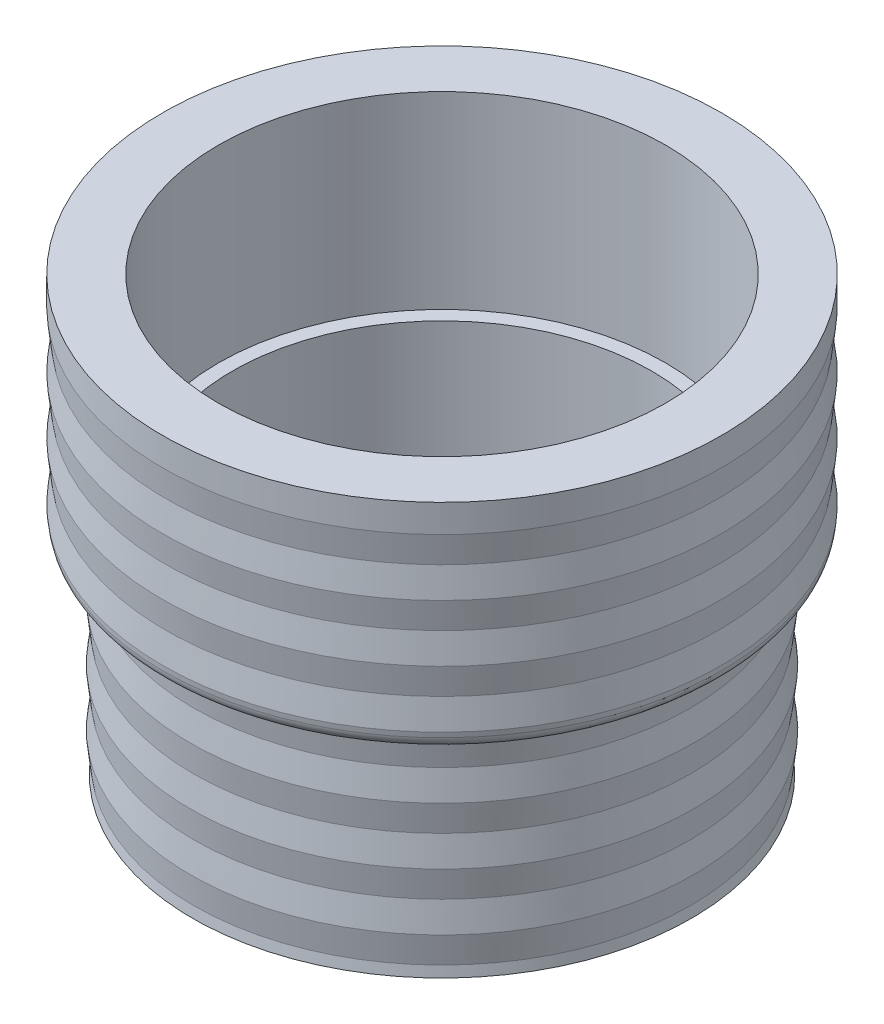
ISO-10303-21;
HEADER;
FILE_DESCRIPTION(('STEP AP214'),'2;1');
FILE_NAME('part.step','',(''),(''),'','','');
FILE_SCHEMA(('AUTOMOTIVE_DESIGN { 1 0 10303 214 1 1 1 1 }'));
ENDSEC;
DATA;
#1=APPLICATION_CONTEXT('core data for automotive mechanical design processes');
#2=APPLICATION_PROTOCOL_DEFINITION('international standard','automotive_design',2000,#1);
#3=PRODUCT_CONTEXT('',#1,'mechanical');
#4=PRODUCT('Part','Part','',(#3));
#5=PRODUCT_RELATED_PRODUCT_CATEGORY('part','',(#4));
#6=PRODUCT_DEFINITION_FORMATION('','',#4);
#7=PRODUCT_DEFINITION_CONTEXT('part definition',#1,'design');
#8=PRODUCT_DEFINITION('design','',#6,#7);
#9=PRODUCT_DEFINITION_SHAPE('','',#8);
#10=(LENGTH_UNIT() NAMED_UNIT(*) SI_UNIT(.MILLI.,.METRE.));
#11=(NAMED_UNIT(*) PLANE_ANGLE_UNIT() SI_UNIT($,.RADIAN.));
#12=(NAMED_UNIT(*) SI_UNIT($,.STERADIAN.) SOLID_ANGLE_UNIT());
#13=UNCERTAINTY_MEASURE_WITH_UNIT(LENGTH_MEASURE(1.E-05),#10,'distance_accuracy_value','');
#14=(GEOMETRIC_REPRESENTATION_CONTEXT(3) GLOBAL_UNCERTAINTY_ASSIGNED_CONTEXT((#13)) GLOBAL_UNIT_ASSIGNED_CONTEXT((#10,
#11,#12)) REPRESENTATION_CONTEXT('',''));
#15=CARTESIAN_POINT('',(0.,0.,0.));
#16=DIRECTION('',(0.,0.,1.));
#17=DIRECTION('',(1.,0.,0.));
#18=AXIS2_PLACEMENT_3D('',#15,#16,#17);
#19=CARTESIAN_POINT('',(0.,-40.6565698055981,0.));
#20=DIRECTION('',(0.,-1.,0.));
#21=DIRECTION('',(0.,0.,-1.));
#22=AXIS2_PLACEMENT_3D('',#19,#20,#21);
#23=CYLINDRICAL_SURFACE('',#22,31.75);
#24=CARTESIAN_POINT('',(0.,46.0375,0.));
#25=DIRECTION('',(0.,-1.,0.));
#26=DIRECTION('',(0.,0.,-1.));
#27=AXIS2_PLACEMENT_3D('',#24,#25,#26);
#28=CIRCLE('',#27,31.75);
#29=CARTESIAN_POINT('',(0.,46.0375,-31.75));
#30=VERTEX_POINT('',#29);
#31=EDGE_CURVE('E76',#30,#30,#28,.T.);
#32=ORIENTED_EDGE('',*,*,#31,.F.);
#33=EDGE_LOOP('',(#32));
#34=FACE_BOUND('',#33,.T.);
#35=CARTESIAN_POINT('',(0.,49.2125,0.));
#36=DIRECTION('',(0.,-1.,0.));
#37=DIRECTION('',(0.,0.,-1.));
#38=AXIS2_PLACEMENT_3D('',#35,#36,#37);
#39=CIRCLE('',#38,31.75);
#40=CARTESIAN_POINT('',(0.,49.2125,-31.75));
#41=VERTEX_POINT('',#40);
#42=EDGE_CURVE('E64',#41,#41,#39,.T.);
#43=ORIENTED_EDGE('',*,*,#42,.T.);
#44=EDGE_LOOP('',(#43));
#45=FACE_BOUND('',#44,.T.);
#46=ADVANCED_FACE('F33',(#34,#45),#23,.T.);
#47=CARTESIAN_POINT('',(0.,-40.6565698055981,0.));
#48=DIRECTION('',(0.,-1.,0.));
#49=DIRECTION('',(0.,0.,-1.));
#50=AXIS2_PLACEMENT_3D('',#47,#48,#49);
#51=CYLINDRICAL_SURFACE('',#50,23.8125);
#52=CARTESIAN_POINT('',(0.,27.78125,0.));
#53=DIRECTION('',(0.,-1.,0.));
#54=DIRECTION('',(0.,0.,-1.));
#55=AXIS2_PLACEMENT_3D('',#52,#53,#54);
#56=CIRCLE('',#55,23.8125);
#57=CARTESIAN_POINT('',(0.,27.78125,-23.8125));
#58=VERTEX_POINT('',#57);
#59=EDGE_CURVE('E73',#58,#58,#56,.T.);
#60=ORIENTED_EDGE('',*,*,#59,.F.);
#61=EDGE_LOOP('',(#60));
#62=FACE_BOUND('',#61,.T.);
#63=CARTESIAN_POINT('',(0.,6.35,0.));
#64=DIRECTION('',(0.,-1.,0.));
#65=DIRECTION('',(0.,0.,-1.));
#66=AXIS2_PLACEMENT_3D('',#63,#64,#65);
#67=CIRCLE('',#66,23.8125);
#68=CARTESIAN_POINT('',(0.,6.35,-23.8125));
#69=VERTEX_POINT('',#68);
#70=EDGE_CURVE('E44',#69,#69,#67,.T.);
#71=ORIENTED_EDGE('',*,*,#70,.T.);
#72=EDGE_LOOP('',(#71));
#73=FACE_BOUND('',#72,.T.);
#74=ADVANCED_FACE('F161',(#62,#73),#51,.F.);
#75=CARTESIAN_POINT('',(0.,6.35,0.));
#76=DIRECTION('',(0.,-1.,0.));
#77=DIRECTION('',(0.,0.,-1.));
#78=AXIS2_PLACEMENT_3D('',#75,#76,#77);
#79=PLANE('',#78);
#80=ORIENTED_EDGE('',*,*,#70,.F.);
#81=EDGE_LOOP('',(#80));
#82=FACE_BOUND('',#81,.T.);
#83=CARTESIAN_POINT('',(0.,6.35,0.));
#84=DIRECTION('',(0.,-1.,0.));
#85=DIRECTION('',(0.,0.,-1.));
#86=AXIS2_PLACEMENT_3D('',#83,#84,#85);
#87=CIRCLE('',#86,22.225);
#88=CARTESIAN_POINT('',(0.,6.35,-22.225));
#89=VERTEX_POINT('',#88);
#90=EDGE_CURVE('E48',#89,#89,#87,.T.);
#91=ORIENTED_EDGE('',*,*,#90,.T.);
#92=EDGE_LOOP('',(#91));
#93=FACE_BOUND('',#92,.T.);
#94=ADVANCED_FACE('F185',(#82,#93),#79,.F.);
#95=CARTESIAN_POINT('',(0.,-40.6565698055981,0.));
#96=DIRECTION('',(0.,-1.,0.));
#97=DIRECTION('',(0.,0.,-1.));
#98=AXIS2_PLACEMENT_3D('',#95,#96,#97);
#99=CYLINDRICAL_SURFACE('',#98,22.225);
#100=ORIENTED_EDGE('',*,*,#90,.F.);
#101=EDGE_LOOP('',(#100));
#102=FACE_BOUND('',#101,.T.);
#103=CARTESIAN_POINT('',(0.,0.,0.));
#104=DIRECTION('',(0.,-1.,0.));
#105=DIRECTION('',(0.,0.,-1.));
#106=AXIS2_PLACEMENT_3D('',#103,#104,#105);
#107=CIRCLE('',#106,22.225);
#108=CARTESIAN_POINT('',(0.,0.,-22.225));
#109=VERTEX_POINT('',#108);
#110=EDGE_CURVE('E58',#109,#109,#107,.T.);
#111=ORIENTED_EDGE('',*,*,#110,.T.);
#112=EDGE_LOOP('',(#111));
#113=FACE_BOUND('',#112,.T.);
#114=ADVANCED_FACE('F190',(#102,#113),#99,.F.);
#115=CARTESIAN_POINT('',(0.,0.,0.));
#116=DIRECTION('',(0.,-1.,0.));
#117=DIRECTION('',(0.,0.,-1.));
#118=AXIS2_PLACEMENT_3D('',#115,#116,#117);
#119=PLANE('',#118);
#120=CARTESIAN_POINT('',(0.,0.,0.));
#121=DIRECTION('',(0.,-1.,0.));
#122=DIRECTION('',(0.,0.,-1.));
#123=AXIS2_PLACEMENT_3D('',#120,#121,#122);
#124=CIRCLE('',#123,28.332205882353);
#125=CARTESIAN_POINT('',(0.,0.,-28.332205882353));
#126=VERTEX_POINT('',#125);
#127=EDGE_CURVE('E51',#126,#126,#124,.F.);
#128=ORIENTED_EDGE('',*,*,#127,.F.);
#129=EDGE_LOOP('',(#128));
#130=FACE_BOUND('',#129,.T.);
#131=ORIENTED_EDGE('',*,*,#110,.F.);
#132=EDGE_LOOP('',(#131));
#133=FACE_BOUND('',#132,.T.);
#134=ADVANCED_FACE('F169',(#130,#133),#119,.T.);
#135=CARTESIAN_POINT('',(0.,49.2125,0.));
#136=DIRECTION('',(0.,-1.,0.));
#137=DIRECTION('',(0.,0.,-1.));
#138=AXIS2_PLACEMENT_3D('',#135,#136,#137);
#139=PLANE('',#138);
#140=ORIENTED_EDGE('',*,*,#42,.F.);
#141=EDGE_LOOP('',(#140));
#142=FACE_BOUND('',#141,.T.);
#143=CARTESIAN_POINT('',(0.,49.2125,0.));
#144=DIRECTION('',(0.,-1.,0.));
#145=DIRECTION('',(0.,0.,-1.));
#146=AXIS2_PLACEMENT_3D('',#143,#144,#145);
#147=CIRCLE('',#146,25.4);
#148=CARTESIAN_POINT('',(0.,49.2125,-25.4));
#149=VERTEX_POINT('',#148);
#150=EDGE_CURVE('E67',#149,#149,#147,.T.);
#151=ORIENTED_EDGE('',*,*,#150,.T.);
#152=EDGE_LOOP('',(#151));
#153=FACE_BOUND('',#152,.T.);
#154=ADVANCED_FACE('F165',(#142,#153),#139,.F.);
#155=CARTESIAN_POINT('',(0.,-40.6565698055981,0.));
#156=DIRECTION('',(0.,-1.,0.));
#157=DIRECTION('',(0.,0.,-1.));
#158=AXIS2_PLACEMENT_3D('',#155,#156,#157);
#159=CYLINDRICAL_SURFACE('',#158,25.4);
#160=ORIENTED_EDGE('',*,*,#150,.F.);
#161=EDGE_LOOP('',(#160));
#162=FACE_BOUND('',#161,.T.);
#163=CARTESIAN_POINT('',(0.,27.78125,0.));
#164=DIRECTION('',(0.,-1.,0.));
#165=DIRECTION('',(0.,0.,-1.));
#166=AXIS2_PLACEMENT_3D('',#163,#164,#165);
#167=CIRCLE('',#166,25.4);
#168=CARTESIAN_POINT('',(0.,27.78125,-25.4));
#169=VERTEX_POINT('',#168);
#170=EDGE_CURVE('E70',#169,#169,#167,.T.);
#171=ORIENTED_EDGE('',*,*,#170,.T.);
#172=EDGE_LOOP('',(#171));
#173=FACE_BOUND('',#172,.T.);
#174=ADVANCED_FACE('F168',(#162,#173),#159,.F.);
#175=CARTESIAN_POINT('',(0.,27.78125,0.));
#176=DIRECTION('',(0.,-1.,0.));
#177=DIRECTION('',(0.,0.,-1.));
#178=AXIS2_PLACEMENT_3D('',#175,#176,#177);
#179=PLANE('',#178);
#180=ORIENTED_EDGE('',*,*,#170,.F.);
#181=EDGE_LOOP('',(#180));
#182=FACE_BOUND('',#181,.T.);
#183=ORIENTED_EDGE('',*,*,#59,.T.);
#184=EDGE_LOOP('',(#183));
#185=FACE_BOUND('',#184,.T.);
#186=ADVANCED_FACE('F155',(#182,#185),#179,.F.);
#187=CARTESIAN_POINT('',(0.,46.0375,0.));
#188=DIRECTION('',(0.,1.,0.));
#189=DIRECTION('',(0.,0.,1.));
#190=AXIS2_PLACEMENT_3D('',#187,#188,#189);
#191=CONICAL_SURFACE('',#190,31.75,0.117108744566864);
#192=CARTESIAN_POINT('',(0.,42.799,0.));
#193=DIRECTION('',(0.,-1.,0.));
#194=DIRECTION('',(0.,0.,-1.));
#195=AXIS2_PLACEMENT_3D('',#192,#193,#194);
#196=CIRCLE('',#195,31.369);
#197=CARTESIAN_POINT('',(0.,42.799,-31.369));
#198=VERTEX_POINT('',#197);
#199=EDGE_CURVE('E80',#198,#198,#196,.T.);
#200=ORIENTED_EDGE('',*,*,#199,.F.);
#201=EDGE_LOOP('',(#200));
#202=FACE_BOUND('',#201,.T.);
#203=ORIENTED_EDGE('',*,*,#31,.T.);
#204=EDGE_LOOP('',(#203));
#205=FACE_BOUND('',#204,.T.);
#206=ADVANCED_FACE('F149',(#202,#205),#191,.T.);
#207=CARTESIAN_POINT('',(0.,42.799,0.));
#208=DIRECTION('',(0.,-1.,0.));
#209=DIRECTION('',(0.,0.,-1.));
#210=AXIS2_PLACEMENT_3D('',#207,#208,#209);
#211=CONICAL_SURFACE('',#210,31.369,0.117108744566864);
#212=CARTESIAN_POINT('',(0.,39.5605,0.));
#213=DIRECTION('',(0.,-1.,0.));
#214=DIRECTION('',(0.,0.,-1.));
#215=AXIS2_PLACEMENT_3D('',#212,#213,#214);
#216=CIRCLE('',#215,31.75);
#217=CARTESIAN_POINT('',(0.,39.5605,-31.75));
#218=VERTEX_POINT('',#217);
#219=EDGE_CURVE('E84',#218,#218,#216,.T.);
#220=ORIENTED_EDGE('',*,*,#219,.F.);
#221=EDGE_LOOP('',(#220));
#222=FACE_BOUND('',#221,.T.);
#223=ORIENTED_EDGE('',*,*,#199,.T.);
#224=EDGE_LOOP('',(#223));
#225=FACE_BOUND('',#224,.T.);
#226=ADVANCED_FACE('F143',(#222,#225),#211,.T.);
#227=CARTESIAN_POINT('',(0.,39.5605,0.));
#228=DIRECTION('',(0.,1.,0.));
#229=DIRECTION('',(0.,0.,1.));
#230=AXIS2_PLACEMENT_3D('',#227,#228,#229);
#231=CONICAL_SURFACE('',#230,31.75,0.117108744566864);
#232=CARTESIAN_POINT('',(0.,36.322,0.));
#233=DIRECTION('',(0.,-1.,0.));
#234=DIRECTION('',(0.,0.,-1.));
#235=AXIS2_PLACEMENT_3D('',#232,#233,#234);
#236=CIRCLE('',#235,31.369);
#237=CARTESIAN_POINT('',(0.,36.322,-31.369));
#238=VERTEX_POINT('',#237);
#239=EDGE_CURVE('E92',#238,#238,#236,.T.);
#240=ORIENTED_EDGE('',*,*,#239,.F.);
#241=EDGE_LOOP('',(#240));
#242=FACE_BOUND('',#241,.T.);
#243=ORIENTED_EDGE('',*,*,#219,.T.);
#244=EDGE_LOOP('',(#243));
#245=FACE_BOUND('',#244,.T.);
#246=ADVANCED_FACE('F137',(#242,#245),#231,.T.);
#247=CARTESIAN_POINT('',(0.,36.322,0.));
#248=DIRECTION('',(0.,-1.,0.));
#249=DIRECTION('',(0.,0.,-1.));
#250=AXIS2_PLACEMENT_3D('',#247,#248,#249);
#251=CONICAL_SURFACE('',#250,31.369,0.117108744566864);
#252=CARTESIAN_POINT('',(0.,33.0835,0.));
#253=DIRECTION('',(0.,-1.,0.));
#254=DIRECTION('',(0.,0.,-1.));
#255=AXIS2_PLACEMENT_3D('',#252,#253,#254);
#256=CIRCLE('',#255,31.75);
#257=CARTESIAN_POINT('',(0.,33.0835,-31.75));
#258=VERTEX_POINT('',#257);
#259=EDGE_CURVE('E96',#258,#258,#256,.T.);
#260=ORIENTED_EDGE('',*,*,#259,.F.);
#261=EDGE_LOOP('',(#260));
#262=FACE_BOUND('',#261,.T.);
#263=ORIENTED_EDGE('',*,*,#239,.T.);
#264=EDGE_LOOP('',(#263));
#265=FACE_BOUND('',#264,.T.);
#266=ADVANCED_FACE('F131',(#262,#265),#251,.T.);
#267=CARTESIAN_POINT('',(0.,33.0835,0.));
#268=DIRECTION('',(0.,1.,0.));
#269=DIRECTION('',(0.,0.,1.));
#270=AXIS2_PLACEMENT_3D('',#267,#268,#269);
#271=CONICAL_SURFACE('',#270,31.75,0.117108744566864);
#272=CARTESIAN_POINT('',(0.,29.845,0.));
#273=DIRECTION('',(0.,-1.,0.));
#274=DIRECTION('',(0.,0.,-1.));
#275=AXIS2_PLACEMENT_3D('',#272,#273,#274);
#276=CIRCLE('',#275,31.369);
#277=CARTESIAN_POINT('',(0.,29.845,-31.369));
#278=VERTEX_POINT('',#277);
#279=EDGE_CURVE('E104',#278,#278,#276,.T.);
#280=ORIENTED_EDGE('',*,*,#279,.F.);
#281=EDGE_LOOP('',(#280));
#282=FACE_BOUND('',#281,.T.);
#283=ORIENTED_EDGE('',*,*,#259,.T.);
#284=EDGE_LOOP('',(#283));
#285=FACE_BOUND('',#284,.T.);
#286=ADVANCED_FACE('F125',(#282,#285),#271,.T.);
#287=CARTESIAN_POINT('',(0.,29.845,0.));
#288=DIRECTION('',(0.,-1.,0.));
#289=DIRECTION('',(0.,0.,-1.));
#290=AXIS2_PLACEMENT_3D('',#287,#288,#289);
#291=CONICAL_SURFACE('',#290,31.369,0.117108744566864);
#292=CARTESIAN_POINT('',(0.,26.6065,0.));
#293=DIRECTION('',(0.,-1.,0.));
#294=DIRECTION('',(0.,0.,-1.));
#295=AXIS2_PLACEMENT_3D('',#292,#293,#294);
#296=CIRCLE('',#295,31.75);
#297=CARTESIAN_POINT('',(0.,26.6065,-31.75));
#298=VERTEX_POINT('',#297);
#299=EDGE_CURVE('E54',#298,#298,#296,.T.);
#300=ORIENTED_EDGE('',*,*,#299,.F.);
#301=EDGE_LOOP('',(#300));
#302=FACE_BOUND('',#301,.T.);
#303=ORIENTED_EDGE('',*,*,#279,.T.);
#304=EDGE_LOOP('',(#303));
#305=FACE_BOUND('',#304,.T.);
#306=ADVANCED_FACE('F122',(#302,#305),#291,.T.);
#307=CARTESIAN_POINT('',(0.,26.6065,0.));
#308=DIRECTION('',(0.,1.,0.));
#309=DIRECTION('',(0.,0.,1.));
#310=AXIS2_PLACEMENT_3D('',#307,#308,#309);
#311=CONICAL_SURFACE('',#310,31.75,0.117108744566864);
#312=CARTESIAN_POINT('',(0.,26.0082645194868,0.));
#313=DIRECTION('',(0.,1.,0.));
#314=DIRECTION('',(0.,0.,1.));
#315=AXIS2_PLACEMENT_3D('',#312,#313,#314);
#316=CIRCLE('',#315,31.6796193552337);
#317=CARTESIAN_POINT('',(0.,26.0082645194868,31.6796193552337));
#318=VERTEX_POINT('',#317);
#319=EDGE_CURVE('E40',#318,#318,#316,.T.);
#320=ORIENTED_EDGE('',*,*,#319,.T.);
#321=EDGE_LOOP('',(#320));
#322=FACE_BOUND('',#321,.T.);
#323=ORIENTED_EDGE('',*,*,#299,.T.);
#324=EDGE_LOOP('',(#323));
#325=FACE_BOUND('',#324,.T.);
#326=ADVANCED_FACE('F120',(#322,#325),#311,.T.);
#327=CARTESIAN_POINT('',(0.,20.60575,0.));
#328=DIRECTION('',(0.,-1.,0.));
#329=DIRECTION('',(0.,0.,-1.));
#330=AXIS2_PLACEMENT_3D('',#327,#328,#329);
#331=CONICAL_SURFACE('',#330,28.194,0.117108744566856);
#332=CARTESIAN_POINT('',(0.,17.36725,0.));
#333=DIRECTION('',(0.,-1.,0.));
#334=DIRECTION('',(0.,0.,-1.));
#335=AXIS2_PLACEMENT_3D('',#332,#333,#334);
#336=CIRCLE('',#335,28.575);
#337=CARTESIAN_POINT('',(0.,17.36725,-28.575));
#338=VERTEX_POINT('',#337);
#339=EDGE_CURVE('E93',#338,#338,#336,.T.);
#340=ORIENTED_EDGE('',*,*,#339,.F.);
#341=EDGE_LOOP('',(#340));
#342=FACE_BOUND('',#341,.T.);
#343=CARTESIAN_POINT('',(0.,20.60575,0.));
#344=DIRECTION('',(0.,-1.,0.));
#345=DIRECTION('',(0.,0.,-1.));
#346=AXIS2_PLACEMENT_3D('',#343,#344,#345);
#347=CIRCLE('',#346,28.194);
#348=CARTESIAN_POINT('',(0.,20.60575,-28.194));
#349=VERTEX_POINT('',#348);
#350=EDGE_CURVE('E77',#349,#349,#347,.T.);
#351=ORIENTED_EDGE('',*,*,#350,.T.);
#352=EDGE_LOOP('',(#351));
#353=FACE_BOUND('',#352,.T.);
#354=ADVANCED_FACE('F217',(#342,#353),#331,.T.);
#355=CARTESIAN_POINT('',(0.,23.84425,0.));
#356=DIRECTION('',(0.,1.,0.));
#357=DIRECTION('',(0.,0.,1.));
#358=AXIS2_PLACEMENT_3D('',#355,#356,#357);
#359=CONICAL_SURFACE('',#358,28.575,0.117108744566855);
#360=ORIENTED_EDGE('',*,*,#350,.F.);
#361=EDGE_LOOP('',(#360));
#362=FACE_BOUND('',#361,.T.);
#363=CARTESIAN_POINT('',(0.,23.84425,0.));
#364=DIRECTION('',(0.,-1.,0.));
#365=DIRECTION('',(0.,0.,-1.));
#366=AXIS2_PLACEMENT_3D('',#363,#364,#365);
#367=CIRCLE('',#366,28.575);
#368=CARTESIAN_POINT('',(0.,23.84425,-28.575));
#369=VERTEX_POINT('',#368);
#370=EDGE_CURVE('E81',#369,#369,#367,.T.);
#371=ORIENTED_EDGE('',*,*,#370,.T.);
#372=EDGE_LOOP('',(#371));
#373=FACE_BOUND('',#372,.T.);
#374=ADVANCED_FACE('F210',(#362,#373),#359,.T.);
#375=CARTESIAN_POINT('',(0.,-40.6565698055981,0.));
#376=DIRECTION('',(0.,-1.,0.));
#377=DIRECTION('',(0.,0.,-1.));
#378=AXIS2_PLACEMENT_3D('',#375,#376,#377);
#379=CYLINDRICAL_SURFACE('',#378,28.575);
#380=ORIENTED_EDGE('',*,*,#370,.F.);
#381=EDGE_LOOP('',(#380));
#382=FACE_BOUND('',#381,.T.);
#383=CARTESIAN_POINT('',(0.,24.60625,0.));
#384=DIRECTION('',(0.,-1.,0.));
#385=DIRECTION('',(0.,0.,-1.));
#386=AXIS2_PLACEMENT_3D('',#383,#384,#385);
#387=CIRCLE('',#386,28.575);
#388=CARTESIAN_POINT('',(0.,24.60625,-28.575));
#389=VERTEX_POINT('',#388);
#390=EDGE_CURVE('E61',#389,#389,#387,.T.);
#391=ORIENTED_EDGE('',*,*,#390,.T.);
#392=EDGE_LOOP('',(#391));
#393=FACE_BOUND('',#392,.T.);
#394=ADVANCED_FACE('F206',(#382,#393),#379,.T.);
#395=CARTESIAN_POINT('',(0.,24.60625,0.));
#396=DIRECTION('',(0.,-1.,0.));
#397=DIRECTION('',(0.,0.,-1.));
#398=AXIS2_PLACEMENT_3D('',#395,#396,#397);
#399=PLANE('',#398);
#400=CARTESIAN_POINT('',(0.,24.60625,0.));
#401=DIRECTION('',(0.,-1.,0.));
#402=DIRECTION('',(0.,0.,-1.));
#403=AXIS2_PLACEMENT_3D('',#400,#401,#402);
#404=CIRCLE('',#403,30.1029927708712);
#405=CARTESIAN_POINT('',(0.,24.60625,-30.1029927708712));
#406=VERTEX_POINT('',#405);
#407=EDGE_CURVE('E10',#406,#406,#404,.T.);
#408=ORIENTED_EDGE('',*,*,#407,.T.);
#409=EDGE_LOOP('',(#408));
#410=FACE_BOUND('',#409,.T.);
#411=ORIENTED_EDGE('',*,*,#390,.F.);
#412=EDGE_LOOP('',(#411));
#413=FACE_BOUND('',#412,.T.);
#414=ADVANCED_FACE('F209',(#410,#413),#399,.T.);
#415=CARTESIAN_POINT('',(0.,17.36725,0.));
#416=DIRECTION('',(0.,1.,0.));
#417=DIRECTION('',(0.,0.,1.));
#418=AXIS2_PLACEMENT_3D('',#415,#416,#417);
#419=CONICAL_SURFACE('',#418,28.575,0.117108744566855);
#420=CARTESIAN_POINT('',(0.,14.12875,0.));
#421=DIRECTION('',(0.,-1.,0.));
#422=DIRECTION('',(0.,0.,-1.));
#423=AXIS2_PLACEMENT_3D('',#420,#421,#422);
#424=CIRCLE('',#423,28.194);
#425=CARTESIAN_POINT('',(0.,14.12875,-28.194));
#426=VERTEX_POINT('',#425);
#427=EDGE_CURVE('E89',#426,#426,#424,.T.);
#428=ORIENTED_EDGE('',*,*,#427,.F.);
#429=EDGE_LOOP('',(#428));
#430=FACE_BOUND('',#429,.T.);
#431=ORIENTED_EDGE('',*,*,#339,.T.);
#432=EDGE_LOOP('',(#431));
#433=FACE_BOUND('',#432,.T.);
#434=ADVANCED_FACE('F213',(#430,#433),#419,.T.);
#435=CARTESIAN_POINT('',(0.,14.12875,0.));
#436=DIRECTION('',(0.,-1.,0.));
#437=DIRECTION('',(0.,0.,-1.));
#438=AXIS2_PLACEMENT_3D('',#435,#436,#437);
#439=CONICAL_SURFACE('',#438,28.194,0.117108744566856);
#440=CARTESIAN_POINT('',(0.,10.89025,0.));
#441=DIRECTION('',(0.,-1.,0.));
#442=DIRECTION('',(0.,0.,-1.));
#443=AXIS2_PLACEMENT_3D('',#440,#441,#442);
#444=CIRCLE('',#443,28.575);
#445=CARTESIAN_POINT('',(0.,10.89025,-28.575));
#446=VERTEX_POINT('',#445);
#447=EDGE_CURVE('E53',#446,#446,#444,.T.);
#448=ORIENTED_EDGE('',*,*,#447,.F.);
#449=EDGE_LOOP('',(#448));
#450=FACE_BOUND('',#449,.T.);
#451=ORIENTED_EDGE('',*,*,#427,.T.);
#452=EDGE_LOOP('',(#451));
#453=FACE_BOUND('',#452,.T.);
#454=ADVANCED_FACE('F224',(#450,#453),#439,.T.);
#455=CARTESIAN_POINT('',(0.,10.89025,0.));
#456=DIRECTION('',(0.,1.,0.));
#457=DIRECTION('',(0.,0.,1.));
#458=AXIS2_PLACEMENT_3D('',#455,#456,#457);
#459=CONICAL_SURFACE('',#458,28.575,0.117108744566855);
#460=CARTESIAN_POINT('',(0.,7.65175,0.));
#461=DIRECTION('',(0.,-1.,0.));
#462=DIRECTION('',(0.,0.,-1.));
#463=AXIS2_PLACEMENT_3D('',#460,#461,#462);
#464=CIRCLE('',#463,28.194);
#465=CARTESIAN_POINT('',(0.,7.65175,-28.194));
#466=VERTEX_POINT('',#465);
#467=EDGE_CURVE('E101',#466,#466,#464,.T.);
#468=ORIENTED_EDGE('',*,*,#467,.F.);
#469=EDGE_LOOP('',(#468));
#470=FACE_BOUND('',#469,.T.);
#471=ORIENTED_EDGE('',*,*,#447,.T.);
#472=EDGE_LOOP('',(#471));
#473=FACE_BOUND('',#472,.T.);
#474=ADVANCED_FACE('F227',(#470,#473),#459,.T.);
#475=CARTESIAN_POINT('',(0.,7.65175,0.));
#476=DIRECTION('',(0.,-1.,0.));
#477=DIRECTION('',(0.,0.,-1.));
#478=AXIS2_PLACEMENT_3D('',#475,#476,#477);
#479=CONICAL_SURFACE('',#478,28.194,0.117108744566856);
#480=CARTESIAN_POINT('',(0.,4.41325,0.));
#481=DIRECTION('',(0.,-1.,0.));
#482=DIRECTION('',(0.,0.,-1.));
#483=AXIS2_PLACEMENT_3D('',#480,#481,#482);
#484=CIRCLE('',#483,28.575);
#485=CARTESIAN_POINT('',(0.,4.41325,-28.575));
#486=VERTEX_POINT('',#485);
#487=EDGE_CURVE('E114',#486,#486,#484,.T.);
#488=ORIENTED_EDGE('',*,*,#487,.F.);
#489=EDGE_LOOP('',(#488));
#490=FACE_BOUND('',#489,.T.);
#491=ORIENTED_EDGE('',*,*,#467,.T.);
#492=EDGE_LOOP('',(#491));
#493=FACE_BOUND('',#492,.T.);
#494=ADVANCED_FACE('F232',(#490,#493),#479,.T.);
#495=CARTESIAN_POINT('',(0.,4.41325,0.));
#496=DIRECTION('',(0.,1.,0.));
#497=DIRECTION('',(0.,0.,1.));
#498=AXIS2_PLACEMENT_3D('',#495,#496,#497);
#499=CONICAL_SURFACE('',#498,28.575,0.117108744566855);
#500=CARTESIAN_POINT('',(0.,1.17475,0.));
#501=DIRECTION('',(0.,-1.,0.));
#502=DIRECTION('',(0.,0.,-1.));
#503=AXIS2_PLACEMENT_3D('',#500,#501,#502);
#504=CIRCLE('',#503,28.194);
#505=CARTESIAN_POINT('',(0.,1.17475,-28.194));
#506=VERTEX_POINT('',#505);
#507=EDGE_CURVE('E111',#506,#506,#504,.T.);
#508=ORIENTED_EDGE('',*,*,#507,.F.);
#509=EDGE_LOOP('',(#508));
#510=FACE_BOUND('',#509,.T.);
#511=ORIENTED_EDGE('',*,*,#487,.T.);
#512=EDGE_LOOP('',(#511));
#513=FACE_BOUND('',#512,.T.);
#514=ADVANCED_FACE('F235',(#510,#513),#499,.T.);
#515=CARTESIAN_POINT('',(0.,1.17475,0.));
#516=DIRECTION('',(0.,-1.,0.));
#517=DIRECTION('',(0.,0.,-1.));
#518=AXIS2_PLACEMENT_3D('',#515,#516,#517);
#519=CONICAL_SURFACE('',#518,28.194,0.117108744566856);
#520=ORIENTED_EDGE('',*,*,#127,.T.);
#521=EDGE_LOOP('',(#520));
#522=FACE_BOUND('',#521,.T.);
#523=ORIENTED_EDGE('',*,*,#507,.T.);
#524=EDGE_LOOP('',(#523));
#525=FACE_BOUND('',#524,.T.);
#526=ADVANCED_FACE('F240',(#522,#525),#519,.T.);
#527=CARTESIAN_POINT('',(0.,26.19375,0.));
#528=DIRECTION('',(0.,-1.,0.));
#529=DIRECTION('',(0.,0.,-1.));
#530=AXIS2_PLACEMENT_3D('',#527,#528,#529);
#531=TOROIDAL_SURFACE('',#530,30.1029927708712,1.5875);
#532=ORIENTED_EDGE('',*,*,#407,.F.);
#533=EDGE_LOOP('',(#532));
#534=FACE_BOUND('',#533,.T.);
#535=ORIENTED_EDGE('',*,*,#319,.F.);
#536=EDGE_LOOP('',(#535));
#537=FACE_BOUND('',#536,.T.);
#538=ADVANCED_FACE('F35',(#534,#537),#531,.T.);
#539=CLOSED_SHELL('',(#46,#74,#94,#114,#134,#154,#174,#186,#206,#226,#246,#266,#286,#306,#326,
#354,#374,#394,#414,#434,#454,#474,#494,#514,#526,#538));
#540=MANIFOLD_SOLID_BREP('B2',#539);
#541=ADVANCED_BREP_SHAPE_REPRESENTATION('',(#18,#540),#14);
#542=SHAPE_DEFINITION_REPRESENTATION(#9,#541);
ENDSEC;
END-ISO-10303-21;
